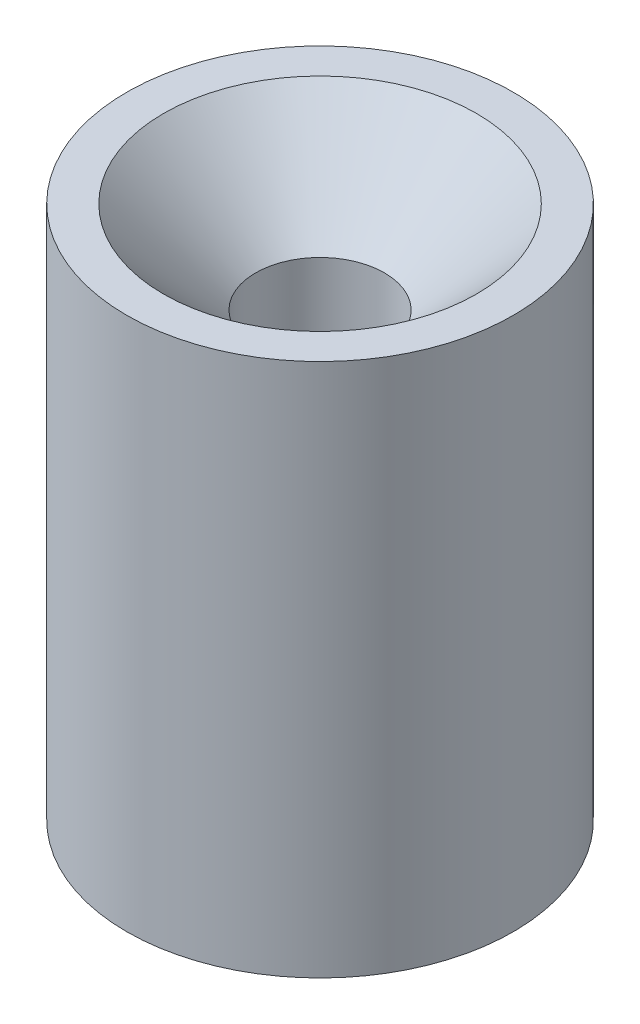
ISO-10303-21;
HEADER;
FILE_DESCRIPTION(('STEP AP214'),'2;1');
FILE_NAME('part.step','',(''),(''),'','','');
FILE_SCHEMA(('AUTOMOTIVE_DESIGN { 1 0 10303 214 1 1 1 1 }'));
ENDSEC;
DATA;
#1=APPLICATION_CONTEXT('core data for automotive mechanical design processes');
#2=APPLICATION_PROTOCOL_DEFINITION('international standard','automotive_design',2000,#1);
#3=PRODUCT_CONTEXT('',#1,'mechanical');
#4=PRODUCT('Part','Part','',(#3));
#5=PRODUCT_RELATED_PRODUCT_CATEGORY('part','',(#4));
#6=PRODUCT_DEFINITION_FORMATION('','',#4);
#7=PRODUCT_DEFINITION_CONTEXT('part definition',#1,'design');
#8=PRODUCT_DEFINITION('design','',#6,#7);
#9=PRODUCT_DEFINITION_SHAPE('','',#8);
#10=(LENGTH_UNIT() NAMED_UNIT(*) SI_UNIT(.MILLI.,.METRE.));
#11=(NAMED_UNIT(*) PLANE_ANGLE_UNIT() SI_UNIT($,.RADIAN.));
#12=(NAMED_UNIT(*) SI_UNIT($,.STERADIAN.) SOLID_ANGLE_UNIT());
#13=UNCERTAINTY_MEASURE_WITH_UNIT(LENGTH_MEASURE(1.E-05),#10,'distance_accuracy_value','');
#14=(GEOMETRIC_REPRESENTATION_CONTEXT(3) GLOBAL_UNCERTAINTY_ASSIGNED_CONTEXT((#13)) GLOBAL_UNIT_ASSIGNED_CONTEXT((#10,
#11,#12)) REPRESENTATION_CONTEXT('',''));
#15=CARTESIAN_POINT('',(0.,0.,0.));
#16=DIRECTION('',(0.,0.,1.));
#17=DIRECTION('',(1.,0.,0.));
#18=AXIS2_PLACEMENT_3D('',#15,#16,#17);
#19=CARTESIAN_POINT('',(0.,-24.,0.));
#20=DIRECTION('',(0.,1.,0.));
#21=DIRECTION('',(0.,0.,1.));
#22=AXIS2_PLACEMENT_3D('',#19,#20,#21);
#23=CYLINDRICAL_SURFACE('',#22,21.);
#24=CARTESIAN_POINT('',(0.,-24.,0.));
#25=DIRECTION('',(0.,1.,0.));
#26=DIRECTION('',(0.,0.,1.));
#27=AXIS2_PLACEMENT_3D('',#24,#25,#26);
#28=CIRCLE('',#27,21.);
#29=CARTESIAN_POINT('',(0.,-24.,21.));
#30=VERTEX_POINT('',#29);
#31=EDGE_CURVE('E10',#30,#30,#28,.T.);
#32=ORIENTED_EDGE('',*,*,#31,.T.);
#33=EDGE_LOOP('',(#32));
#34=FACE_BOUND('',#33,.T.);
#35=CARTESIAN_POINT('',(0.,34.,0.));
#36=DIRECTION('',(0.,1.,0.));
#37=DIRECTION('',(0.,0.,1.));
#38=AXIS2_PLACEMENT_3D('',#35,#36,#37);
#39=CIRCLE('',#38,21.);
#40=CARTESIAN_POINT('',(0.,34.,21.));
#41=VERTEX_POINT('',#40);
#42=EDGE_CURVE('E52',#41,#41,#39,.T.);
#43=ORIENTED_EDGE('',*,*,#42,.F.);
#44=EDGE_LOOP('',(#43));
#45=FACE_BOUND('',#44,.T.);
#46=ADVANCED_FACE('F34',(#34,#45),#23,.T.);
#47=CARTESIAN_POINT('',(0.,-24.,0.));
#48=DIRECTION('',(0.,1.,0.));
#49=DIRECTION('',(0.,0.,1.));
#50=AXIS2_PLACEMENT_3D('',#47,#48,#49);
#51=PLANE('',#50);
#52=CARTESIAN_POINT('',(0.,-24.,0.));
#53=DIRECTION('',(0.,1.,0.));
#54=DIRECTION('',(0.,0.,1.));
#55=AXIS2_PLACEMENT_3D('',#52,#53,#54);
#56=CIRCLE('',#55,13.430780618347);
#57=CARTESIAN_POINT('',(0.,-24.,13.430780618347));
#58=VERTEX_POINT('',#57);
#59=EDGE_CURVE('E41',#58,#58,#56,.F.);
#60=ORIENTED_EDGE('',*,*,#59,.F.);
#61=EDGE_LOOP('',(#60));
#62=FACE_BOUND('',#61,.T.);
#63=ORIENTED_EDGE('',*,*,#31,.F.);
#64=EDGE_LOOP('',(#63));
#65=FACE_BOUND('',#64,.T.);
#66=ADVANCED_FACE('F72',(#62,#65),#51,.F.);
#67=CARTESIAN_POINT('',(0.,24.001,0.));
#68=DIRECTION('',(0.,-1.,0.));
#69=DIRECTION('',(0.,0.,-1.));
#70=AXIS2_PLACEMENT_3D('',#67,#68,#69);
#71=CYLINDRICAL_SURFACE('',#70,7.);
#72=CARTESIAN_POINT('',(0.,24.,0.));
#73=DIRECTION('',(0.,-1.,0.));
#74=DIRECTION('',(0.,0.,-1.));
#75=AXIS2_PLACEMENT_3D('',#72,#73,#74);
#76=CIRCLE('',#75,7.);
#77=CARTESIAN_POINT('',(0.,24.,-7.));
#78=VERTEX_POINT('',#77);
#79=EDGE_CURVE('E58',#78,#78,#76,.T.);
#80=ORIENTED_EDGE('',*,*,#79,.F.);
#81=EDGE_LOOP('',(#80));
#82=FACE_BOUND('',#81,.T.);
#83=CARTESIAN_POINT('',(0.,0.,0.));
#84=DIRECTION('',(0.,1.,0.));
#85=DIRECTION('',(0.,0.,1.));
#86=AXIS2_PLACEMENT_3D('',#83,#84,#85);
#87=CIRCLE('',#86,7.);
#88=CARTESIAN_POINT('',(0.,0.,7.));
#89=VERTEX_POINT('',#88);
#90=EDGE_CURVE('E47',#89,#89,#87,.T.);
#91=ORIENTED_EDGE('',*,*,#90,.F.);
#92=EDGE_LOOP('',(#91));
#93=FACE_BOUND('',#92,.T.);
#94=ADVANCED_FACE('F68',(#82,#93),#71,.F.);
#95=CARTESIAN_POINT('',(0.,0.,0.));
#96=DIRECTION('',(0.,-1.,0.));
#97=DIRECTION('',(0.,0.,1.));
#98=AXIS2_PLACEMENT_3D('',#95,#96,#97);
#99=CONICAL_SURFACE('',#98,7.,0.26179938779915);
#100=ORIENTED_EDGE('',*,*,#90,.T.);
#101=EDGE_LOOP('',(#100));
#102=FACE_BOUND('',#101,.T.);
#103=ORIENTED_EDGE('',*,*,#59,.T.);
#104=EDGE_LOOP('',(#103));
#105=FACE_BOUND('',#104,.T.);
#106=ADVANCED_FACE('F71',(#102,#105),#99,.F.);
#107=CARTESIAN_POINT('',(0.,34.,0.));
#108=DIRECTION('',(0.,1.,0.));
#109=DIRECTION('',(0.,0.,1.));
#110=AXIS2_PLACEMENT_3D('',#107,#108,#109);
#111=PLANE('',#110);
#112=CARTESIAN_POINT('',(0.,34.,0.));
#113=DIRECTION('',(0.,1.,0.));
#114=DIRECTION('',(0.,0.,1.));
#115=AXIS2_PLACEMENT_3D('',#112,#113,#114);
#116=CIRCLE('',#115,17.);
#117=CARTESIAN_POINT('',(0.,34.,17.));
#118=VERTEX_POINT('',#117);
#119=EDGE_CURVE('E59',#118,#118,#116,.F.);
#120=ORIENTED_EDGE('',*,*,#119,.T.);
#121=EDGE_LOOP('',(#120));
#122=FACE_BOUND('',#121,.T.);
#123=ORIENTED_EDGE('',*,*,#42,.T.);
#124=EDGE_LOOP('',(#123));
#125=FACE_BOUND('',#124,.T.);
#126=ADVANCED_FACE('F77',(#122,#125),#111,.T.);
#127=CARTESIAN_POINT('',(0.,24.,0.));
#128=DIRECTION('',(0.,1.,0.));
#129=DIRECTION('',(0.,0.,-1.));
#130=AXIS2_PLACEMENT_3D('',#127,#128,#129);
#131=CONICAL_SURFACE('',#130,7.,0.78539816339745);
#132=ORIENTED_EDGE('',*,*,#119,.F.);
#133=EDGE_LOOP('',(#132));
#134=FACE_BOUND('',#133,.T.);
#135=ORIENTED_EDGE('',*,*,#79,.T.);
#136=EDGE_LOOP('',(#135));
#137=FACE_BOUND('',#136,.T.);
#138=ADVANCED_FACE('F66',(#134,#137),#131,.F.);
#139=CLOSED_SHELL('',(#46,#66,#94,#106,#126,#138));
#140=MANIFOLD_SOLID_BREP('B2',#139);
#141=ADVANCED_BREP_SHAPE_REPRESENTATION('',(#18,#140),#14);
#142=SHAPE_DEFINITION_REPRESENTATION(#9,#141);
ENDSEC;
END-ISO-10303-21;
